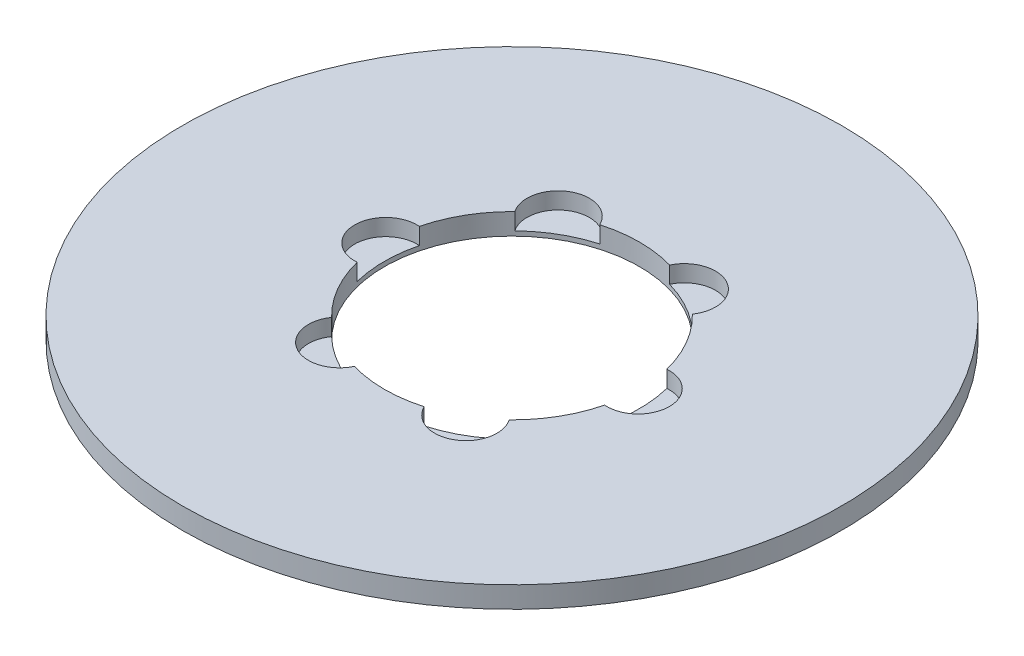
ISO-10303-21;
HEADER;
FILE_DESCRIPTION(('STEP AP214'),'2;1');
FILE_NAME('part.step','',(''),(''),'','','');
FILE_SCHEMA(('AUTOMOTIVE_DESIGN { 1 0 10303 214 1 1 1 1 }'));
ENDSEC;
DATA;
#1=APPLICATION_CONTEXT('core data for automotive mechanical design processes');
#2=APPLICATION_PROTOCOL_DEFINITION('international standard','automotive_design',2000,#1);
#3=PRODUCT_CONTEXT('',#1,'mechanical');
#4=PRODUCT('Part','Part','',(#3));
#5=PRODUCT_RELATED_PRODUCT_CATEGORY('part','',(#4));
#6=PRODUCT_DEFINITION_FORMATION('','',#4);
#7=PRODUCT_DEFINITION_CONTEXT('part definition',#1,'design');
#8=PRODUCT_DEFINITION('design','',#6,#7);
#9=PRODUCT_DEFINITION_SHAPE('','',#8);
#10=(LENGTH_UNIT() NAMED_UNIT(*) SI_UNIT(.MILLI.,.METRE.));
#11=(NAMED_UNIT(*) PLANE_ANGLE_UNIT() SI_UNIT($,.RADIAN.));
#12=(NAMED_UNIT(*) SI_UNIT($,.STERADIAN.) SOLID_ANGLE_UNIT());
#13=UNCERTAINTY_MEASURE_WITH_UNIT(LENGTH_MEASURE(1.E-05),#10,'distance_accuracy_value','');
#14=(GEOMETRIC_REPRESENTATION_CONTEXT(3) GLOBAL_UNCERTAINTY_ASSIGNED_CONTEXT((#13)) GLOBAL_UNIT_ASSIGNED_CONTEXT((#10,
#11,#12)) REPRESENTATION_CONTEXT('',''));
#15=CARTESIAN_POINT('',(0.,0.,0.));
#16=DIRECTION('',(0.,0.,1.));
#17=DIRECTION('',(1.,0.,0.));
#18=AXIS2_PLACEMENT_3D('',#15,#16,#17);
#19=CARTESIAN_POINT('',(0.,5.,0.));
#20=DIRECTION('',(0.,-1.,0.));
#21=DIRECTION('',(0.,0.,-1.));
#22=AXIS2_PLACEMENT_3D('',#19,#20,#21);
#23=CYLINDRICAL_SURFACE('',#22,77.5);
#24=CARTESIAN_POINT('',(0.,5.,0.));
#25=DIRECTION('',(0.,1.,0.));
#26=DIRECTION('',(0.,0.,1.));
#27=AXIS2_PLACEMENT_3D('',#24,#25,#26);
#28=CIRCLE('',#27,77.5);
#29=CARTESIAN_POINT('',(0.,5.,77.5));
#30=VERTEX_POINT('',#29);
#31=EDGE_CURVE('E171',#30,#30,#28,.T.);
#32=ORIENTED_EDGE('',*,*,#31,.F.);
#33=EDGE_LOOP('',(#32));
#34=FACE_BOUND('',#33,.T.);
#35=CARTESIAN_POINT('',(0.,0.,0.));
#36=DIRECTION('',(0.,1.,0.));
#37=DIRECTION('',(0.,0.,1.));
#38=AXIS2_PLACEMENT_3D('',#35,#36,#37);
#39=CIRCLE('',#38,77.5);
#40=CARTESIAN_POINT('',(0.,0.,77.5));
#41=VERTEX_POINT('',#40);
#42=EDGE_CURVE('E157',#41,#41,#39,.T.);
#43=ORIENTED_EDGE('',*,*,#42,.T.);
#44=EDGE_LOOP('',(#43));
#45=FACE_BOUND('',#44,.T.);
#46=ADVANCED_FACE('F39',(#34,#45),#23,.T.);
#47=CARTESIAN_POINT('',(0.,5.,0.));
#48=DIRECTION('',(0.,1.,0.));
#49=DIRECTION('',(0.,0.,1.));
#50=AXIS2_PLACEMENT_3D('',#47,#48,#49);
#51=PLANE('',#50);
#52=CARTESIAN_POINT('',(-14.8331722885129,5.,-25.6918080411264));
#53=DIRECTION('',(0.,1.,0.));
#54=DIRECTION('',(-0.866025403784433,0.,0.50000000000001));
#55=AXIS2_PLACEMENT_3D('',#52,#53,#54);
#56=CIRCLE('',#55,7.33525519988317);
#57=CARTESIAN_POINT('',(-8.21429246454717,5.,-28.8535162381794));
#58=VERTEX_POINT('',#57);
#59=CARTESIAN_POINT('',(-20.8807318184971,5.,-21.5405440675022));
#60=VERTEX_POINT('',#59);
#61=EDGE_CURVE('E214',#58,#60,#56,.T.);
#62=ORIENTED_EDGE('',*,*,#61,.F.);
#63=CARTESIAN_POINT('',(0.,5.,0.));
#64=DIRECTION('',(0.,1.,0.));
#65=DIRECTION('',(0.,0.,1.));
#66=AXIS2_PLACEMENT_3D('',#63,#64,#65);
#67=CIRCLE('',#66,30.);
#68=CARTESIAN_POINT('',(8.21429246454656,5.,-28.8535162381796));
#69=VERTEX_POINT('',#68);
#70=EDGE_CURVE('E272',#69,#58,#67,.T.);
#71=ORIENTED_EDGE('',*,*,#70,.F.);
#72=CARTESIAN_POINT('',(14.8331722885124,5.,-25.6918080411267));
#73=DIRECTION('',(0.,1.,0.));
#74=DIRECTION('',(-0.866025403784443,0.,-0.499999999999992));
#75=AXIS2_PLACEMENT_3D('',#72,#73,#74);
#76=CIRCLE('',#75,7.33525519988317);
#77=CARTESIAN_POINT('',(20.8807318184967,5.,-21.5405440675026));
#78=VERTEX_POINT('',#77);
#79=EDGE_CURVE('E285',#78,#69,#76,.T.);
#80=ORIENTED_EDGE('',*,*,#79,.F.);
#81=CARTESIAN_POINT('',(29.0950242830437,5.,-7.31297217067711));
#82=VERTEX_POINT('',#81);
#83=EDGE_CURVE('E165',#82,#78,#67,.T.);
#84=ORIENTED_EDGE('',*,*,#83,.F.);
#85=CARTESIAN_POINT('',(29.6663445770253,5.,0.));
#86=DIRECTION('',(0.,1.,0.));
#87=DIRECTION('',(0.,0.,-1.));
#88=AXIS2_PLACEMENT_3D('',#85,#86,#87);
#89=CIRCLE('',#88,7.33525519988317);
#90=CARTESIAN_POINT('',(29.0950242830437,5.,7.31297217067711));
#91=VERTEX_POINT('',#90);
#92=EDGE_CURVE('E281',#91,#82,#89,.T.);
#93=ORIENTED_EDGE('',*,*,#92,.F.);
#94=CARTESIAN_POINT('',(20.880731818497,5.,21.5405440675023));
#95=VERTEX_POINT('',#94);
#96=EDGE_CURVE('E160',#95,#91,#67,.T.);
#97=ORIENTED_EDGE('',*,*,#96,.F.);
#98=CARTESIAN_POINT('',(14.8331722885128,5.,25.6918080411265));
#99=DIRECTION('',(0.,1.,0.));
#100=DIRECTION('',(0.866025403784436,0.,-0.500000000000004));
#101=AXIS2_PLACEMENT_3D('',#98,#99,#100);
#102=CIRCLE('',#101,7.33525519988317);
#103=CARTESIAN_POINT('',(8.21429246454697,5.,28.8535162381795));
#104=VERTEX_POINT('',#103);
#105=EDGE_CURVE('E154',#104,#95,#102,.T.);
#106=ORIENTED_EDGE('',*,*,#105,.F.);
#107=CARTESIAN_POINT('',(-8.21429246454677,5.,28.8535162381795));
#108=VERTEX_POINT('',#107);
#109=EDGE_CURVE('E150',#108,#104,#67,.T.);
#110=ORIENTED_EDGE('',*,*,#109,.F.);
#111=CARTESIAN_POINT('',(-14.8331722885126,5.,25.6918080411266));
#112=DIRECTION('',(0.,1.,0.));
#113=DIRECTION('',(0.86602540378444,0.,0.499999999999998));
#114=AXIS2_PLACEMENT_3D('',#111,#112,#113);
#115=CIRCLE('',#114,7.33525519988317);
#116=CARTESIAN_POINT('',(-20.8807318184968,5.,21.5405440675024));
#117=VERTEX_POINT('',#116);
#118=EDGE_CURVE('E127',#117,#108,#115,.T.);
#119=ORIENTED_EDGE('',*,*,#118,.F.);
#120=CARTESIAN_POINT('',(-29.0950242830437,5.,7.31297217067711));
#121=VERTEX_POINT('',#120);
#122=EDGE_CURVE('E156',#121,#117,#67,.T.);
#123=ORIENTED_EDGE('',*,*,#122,.F.);
#124=CARTESIAN_POINT('',(-29.6663445770253,5.,0.));
#125=DIRECTION('',(0.,1.,0.));
#126=DIRECTION('',(0.,0.,1.));
#127=AXIS2_PLACEMENT_3D('',#124,#125,#126);
#128=CIRCLE('',#127,7.33525519988317);
#129=CARTESIAN_POINT('',(-29.0950242830437,5.,-7.31297217067711));
#130=VERTEX_POINT('',#129);
#131=EDGE_CURVE('E164',#130,#121,#128,.T.);
#132=ORIENTED_EDGE('',*,*,#131,.F.);
#133=EDGE_CURVE('E159',#60,#130,#67,.T.);
#134=ORIENTED_EDGE('',*,*,#133,.F.);
#135=EDGE_LOOP('',(#62,#71,#80,#84,#93,#97,#106,#110,#119,#123,#132,#134));
#136=FACE_BOUND('',#135,.T.);
#137=ORIENTED_EDGE('',*,*,#31,.T.);
#138=EDGE_LOOP('',(#137));
#139=FACE_BOUND('',#138,.T.);
#140=ADVANCED_FACE('F155',(#136,#139),#51,.T.);
#141=CARTESIAN_POINT('',(0.,0.,0.));
#142=DIRECTION('',(0.,1.,0.));
#143=DIRECTION('',(0.,0.,1.));
#144=AXIS2_PLACEMENT_3D('',#141,#142,#143);
#145=PLANE('',#144);
#146=CARTESIAN_POINT('',(0.,0.,0.));
#147=DIRECTION('',(0.,1.,0.));
#148=DIRECTION('',(0.,0.,1.));
#149=AXIS2_PLACEMENT_3D('',#146,#147,#148);
#150=CIRCLE('',#149,30.);
#151=CARTESIAN_POINT('',(0.,0.,30.));
#152=VERTEX_POINT('',#151);
#153=EDGE_CURVE('E170',#152,#152,#150,.T.);
#154=ORIENTED_EDGE('',*,*,#153,.T.);
#155=EDGE_LOOP('',(#154));
#156=FACE_BOUND('',#155,.T.);
#157=ORIENTED_EDGE('',*,*,#42,.F.);
#158=EDGE_LOOP('',(#157));
#159=FACE_BOUND('',#158,.T.);
#160=ADVANCED_FACE('F232',(#156,#159),#145,.F.);
#161=CARTESIAN_POINT('',(0.,5.,0.));
#162=DIRECTION('',(0.,-1.,0.));
#163=DIRECTION('',(0.,0.,-1.));
#164=AXIS2_PLACEMENT_3D('',#161,#162,#163);
#165=CYLINDRICAL_SURFACE('',#164,30.);
#166=DIRECTION('',(0.,1.,0.));
#167=VECTOR('',#166,1.);
#168=CARTESIAN_POINT('',(-8.21429246454717,3.04326647324655,-28.8535162381794));
#169=LINE('',#168,#167);
#170=CARTESIAN_POINT('',(-8.21429246454717,1.08653294649309,-28.8535162381794));
#171=VERTEX_POINT('',#170);
#172=EDGE_CURVE('E11',#171,#58,#169,.T.);
#173=ORIENTED_EDGE('',*,*,#172,.F.);
#174=CARTESIAN_POINT('',(0.,1.08653294649309,0.));
#175=DIRECTION('',(0.,1.,0.));
#176=DIRECTION('',(0.,0.,1.));
#177=AXIS2_PLACEMENT_3D('',#174,#175,#176);
#178=CIRCLE('',#177,30.);
#179=CARTESIAN_POINT('',(-20.8807318184971,1.08653294649309,-21.5405440675022));
#180=VERTEX_POINT('',#179);
#181=EDGE_CURVE('E209',#171,#180,#178,.T.);
#182=ORIENTED_EDGE('',*,*,#181,.T.);
#183=DIRECTION('',(0.,1.,0.));
#184=VECTOR('',#183,1.);
#185=CARTESIAN_POINT('',(-20.8807318184971,3.04326647324655,-21.5405440675022));
#186=LINE('',#185,#184);
#187=EDGE_CURVE('E46',#60,#180,#186,.F.);
#188=ORIENTED_EDGE('',*,*,#187,.F.);
#189=ORIENTED_EDGE('',*,*,#133,.T.);
#190=DIRECTION('',(0.,1.,0.));
#191=VECTOR('',#190,1.);
#192=CARTESIAN_POINT('',(-29.0950242830437,3.04326647324655,-7.31297217067711));
#193=LINE('',#192,#191);
#194=CARTESIAN_POINT('',(-29.0950242830437,1.08653294649309,-7.31297217067711));
#195=VERTEX_POINT('',#194);
#196=EDGE_CURVE('E185',#195,#130,#193,.T.);
#197=ORIENTED_EDGE('',*,*,#196,.F.);
#198=CARTESIAN_POINT('',(0.,1.08653294649309,0.));
#199=DIRECTION('',(0.,1.,0.));
#200=DIRECTION('',(0.,0.,1.));
#201=AXIS2_PLACEMENT_3D('',#198,#199,#200);
#202=CIRCLE('',#201,30.);
#203=CARTESIAN_POINT('',(-29.0950242830437,1.08653294649309,7.31297217067711));
#204=VERTEX_POINT('',#203);
#205=EDGE_CURVE('E173',#195,#204,#202,.T.);
#206=ORIENTED_EDGE('',*,*,#205,.T.);
#207=DIRECTION('',(0.,1.,0.));
#208=VECTOR('',#207,1.);
#209=CARTESIAN_POINT('',(-29.0950242830437,3.04326647324655,7.31297217067711));
#210=LINE('',#209,#208);
#211=EDGE_CURVE('E178',#121,#204,#210,.F.);
#212=ORIENTED_EDGE('',*,*,#211,.F.);
#213=ORIENTED_EDGE('',*,*,#122,.T.);
#214=DIRECTION('',(0.,1.,0.));
#215=VECTOR('',#214,1.);
#216=CARTESIAN_POINT('',(-20.8807318184968,3.04326647324655,21.5405440675025));
#217=LINE('',#216,#215);
#218=CARTESIAN_POINT('',(-20.8807318184968,1.08653294649309,21.5405440675024));
#219=VERTEX_POINT('',#218);
#220=EDGE_CURVE('E132',#219,#117,#217,.T.);
#221=ORIENTED_EDGE('',*,*,#220,.F.);
#222=CARTESIAN_POINT('',(0.,1.08653294649309,0.));
#223=DIRECTION('',(0.,1.,0.));
#224=DIRECTION('',(0.,0.,1.));
#225=AXIS2_PLACEMENT_3D('',#222,#223,#224);
#226=CIRCLE('',#225,30.);
#227=CARTESIAN_POINT('',(-8.21429246454677,1.08653294649309,28.8535162381795));
#228=VERTEX_POINT('',#227);
#229=EDGE_CURVE('E146',#219,#228,#226,.T.);
#230=ORIENTED_EDGE('',*,*,#229,.T.);
#231=DIRECTION('',(0.,1.,0.));
#232=VECTOR('',#231,1.);
#233=CARTESIAN_POINT('',(-8.21429246454677,3.04326647324655,28.8535162381795));
#234=LINE('',#233,#232);
#235=EDGE_CURVE('E128',#108,#228,#234,.F.);
#236=ORIENTED_EDGE('',*,*,#235,.F.);
#237=ORIENTED_EDGE('',*,*,#109,.T.);
#238=DIRECTION('',(0.,1.,0.));
#239=VECTOR('',#238,1.);
#240=CARTESIAN_POINT('',(8.21429246454697,3.04326647324655,28.8535162381795));
#241=LINE('',#240,#239);
#242=CARTESIAN_POINT('',(8.21429246454697,1.08653294649309,28.8535162381795));
#243=VERTEX_POINT('',#242);
#244=EDGE_CURVE('E192',#243,#104,#241,.T.);
#245=ORIENTED_EDGE('',*,*,#244,.F.);
#246=CARTESIAN_POINT('',(0.,1.08653294649309,0.));
#247=DIRECTION('',(0.,1.,0.));
#248=DIRECTION('',(0.,0.,1.));
#249=AXIS2_PLACEMENT_3D('',#246,#247,#248);
#250=CIRCLE('',#249,30.);
#251=CARTESIAN_POINT('',(20.880731818497,1.08653294649309,21.5405440675023));
#252=VERTEX_POINT('',#251);
#253=EDGE_CURVE('E190',#243,#252,#250,.T.);
#254=ORIENTED_EDGE('',*,*,#253,.T.);
#255=DIRECTION('',(0.,1.,0.));
#256=VECTOR('',#255,1.);
#257=CARTESIAN_POINT('',(20.880731818497,3.04326647324655,21.5405440675023));
#258=LINE('',#257,#256);
#259=EDGE_CURVE('E189',#95,#252,#258,.F.);
#260=ORIENTED_EDGE('',*,*,#259,.F.);
#261=ORIENTED_EDGE('',*,*,#96,.T.);
#262=DIRECTION('',(0.,1.,0.));
#263=VECTOR('',#262,1.);
#264=CARTESIAN_POINT('',(29.0950242830437,3.04326647324655,7.31297217067711));
#265=LINE('',#264,#263);
#266=CARTESIAN_POINT('',(29.0950242830437,1.08653294649309,7.31297217067711));
#267=VERTEX_POINT('',#266);
#268=EDGE_CURVE('E203',#267,#91,#265,.T.);
#269=ORIENTED_EDGE('',*,*,#268,.F.);
#270=CARTESIAN_POINT('',(0.,1.08653294649309,0.));
#271=DIRECTION('',(0.,1.,0.));
#272=DIRECTION('',(0.,0.,1.));
#273=AXIS2_PLACEMENT_3D('',#270,#271,#272);
#274=CIRCLE('',#273,30.);
#275=CARTESIAN_POINT('',(29.0950242830437,1.08653294649309,-7.31297217067711));
#276=VERTEX_POINT('',#275);
#277=EDGE_CURVE('E194',#267,#276,#274,.T.);
#278=ORIENTED_EDGE('',*,*,#277,.T.);
#279=DIRECTION('',(0.,1.,0.));
#280=VECTOR('',#279,1.);
#281=CARTESIAN_POINT('',(29.0950242830437,3.04326647324655,-7.31297217067711));
#282=LINE('',#281,#280);
#283=EDGE_CURVE('E196',#82,#276,#282,.F.);
#284=ORIENTED_EDGE('',*,*,#283,.F.);
#285=ORIENTED_EDGE('',*,*,#83,.T.);
#286=DIRECTION('',(0.,1.,0.));
#287=VECTOR('',#286,1.);
#288=CARTESIAN_POINT('',(20.8807318184967,3.04326647324655,-21.5405440675026));
#289=LINE('',#288,#287);
#290=CARTESIAN_POINT('',(20.8807318184967,1.08653294649309,-21.5405440675026));
#291=VERTEX_POINT('',#290);
#292=EDGE_CURVE('E208',#291,#78,#289,.T.);
#293=ORIENTED_EDGE('',*,*,#292,.F.);
#294=CARTESIAN_POINT('',(0.,1.08653294649309,0.));
#295=DIRECTION('',(0.,1.,0.));
#296=DIRECTION('',(0.,0.,1.));
#297=AXIS2_PLACEMENT_3D('',#294,#295,#296);
#298=CIRCLE('',#297,30.);
#299=CARTESIAN_POINT('',(8.21429246454656,1.08653294649309,-28.8535162381796));
#300=VERTEX_POINT('',#299);
#301=EDGE_CURVE('E201',#291,#300,#298,.T.);
#302=ORIENTED_EDGE('',*,*,#301,.T.);
#303=DIRECTION('',(0.,1.,0.));
#304=VECTOR('',#303,1.);
#305=CARTESIAN_POINT('',(8.21429246454657,3.04326647324655,-28.8535162381796));
#306=LINE('',#305,#304);
#307=EDGE_CURVE('E206',#69,#300,#306,.F.);
#308=ORIENTED_EDGE('',*,*,#307,.F.);
#309=ORIENTED_EDGE('',*,*,#70,.T.);
#310=EDGE_LOOP('',(#173,#182,#188,#189,#197,#206,#212,#213,#221,#230,#236,#237,#245,#254,#260,
#261,#269,#278,#284,#285,#293,#302,#308,#309));
#311=FACE_BOUND('',#310,.T.);
#312=ORIENTED_EDGE('',*,*,#153,.F.);
#313=EDGE_LOOP('',(#312));
#314=FACE_BOUND('',#313,.T.);
#315=ADVANCED_FACE('F145',(#311,#314),#165,.F.);
#316=CARTESIAN_POINT('',(-29.6663445770253,1.08653294649309,0.));
#317=DIRECTION('',(0.,1.,0.));
#318=DIRECTION('',(0.,0.,1.));
#319=AXIS2_PLACEMENT_3D('',#316,#317,#318);
#320=CYLINDRICAL_SURFACE('',#319,7.33525519988317);
#321=ORIENTED_EDGE('',*,*,#196,.T.);
#322=ORIENTED_EDGE('',*,*,#131,.T.);
#323=ORIENTED_EDGE('',*,*,#211,.T.);
#324=CARTESIAN_POINT('',(-29.6663445770253,1.08653294649309,0.));
#325=DIRECTION('',(0.,1.,0.));
#326=DIRECTION('',(0.,0.,1.));
#327=AXIS2_PLACEMENT_3D('',#324,#325,#326);
#328=CIRCLE('',#327,7.33525519988317);
#329=EDGE_CURVE('E168',#195,#204,#328,.T.);
#330=ORIENTED_EDGE('',*,*,#329,.F.);
#331=EDGE_LOOP('',(#321,#322,#323,#330));
#332=FACE_BOUND('',#331,.T.);
#333=ADVANCED_FACE('F243',(#332),#320,.F.);
#334=CARTESIAN_POINT('',(-29.6663445770253,1.08653294649309,0.));
#335=DIRECTION('',(0.,1.,0.));
#336=DIRECTION('',(0.,0.,1.));
#337=AXIS2_PLACEMENT_3D('',#334,#335,#336);
#338=PLANE('',#337);
#339=ORIENTED_EDGE('',*,*,#329,.T.);
#340=ORIENTED_EDGE('',*,*,#205,.F.);
#341=EDGE_LOOP('',(#339,#340));
#342=FACE_BOUND('',#341,.T.);
#343=ADVANCED_FACE('F247',(#342),#338,.T.);
#344=CARTESIAN_POINT('',(-14.8331722885126,1.08653294649309,25.6918080411266));
#345=DIRECTION('',(0.,1.,0.));
#346=DIRECTION('',(0.,0.,1.));
#347=AXIS2_PLACEMENT_3D('',#344,#345,#346);
#348=CYLINDRICAL_SURFACE('',#347,7.33525519988317);
#349=ORIENTED_EDGE('',*,*,#220,.T.);
#350=ORIENTED_EDGE('',*,*,#118,.T.);
#351=ORIENTED_EDGE('',*,*,#235,.T.);
#352=CARTESIAN_POINT('',(-14.8331722885126,1.08653294649309,25.6918080411266));
#353=DIRECTION('',(0.,1.,0.));
#354=DIRECTION('',(0.86602540378444,0.,0.499999999999998));
#355=AXIS2_PLACEMENT_3D('',#352,#353,#354);
#356=CIRCLE('',#355,7.33525519988317);
#357=EDGE_CURVE('E137',#219,#228,#356,.T.);
#358=ORIENTED_EDGE('',*,*,#357,.F.);
#359=EDGE_LOOP('',(#349,#350,#351,#358));
#360=FACE_BOUND('',#359,.T.);
#361=ADVANCED_FACE('F126',(#360),#348,.F.);
#362=CARTESIAN_POINT('',(-14.8331722885126,1.08653294649309,25.6918080411266));
#363=DIRECTION('',(0.,1.,0.));
#364=DIRECTION('',(0.86602540378444,0.,0.499999999999998));
#365=AXIS2_PLACEMENT_3D('',#362,#363,#364);
#366=PLANE('',#365);
#367=ORIENTED_EDGE('',*,*,#357,.T.);
#368=ORIENTED_EDGE('',*,*,#229,.F.);
#369=EDGE_LOOP('',(#367,#368));
#370=FACE_BOUND('',#369,.T.);
#371=ADVANCED_FACE('F254',(#370),#366,.T.);
#372=CARTESIAN_POINT('',(14.8331722885128,1.08653294649309,25.6918080411265));
#373=DIRECTION('',(0.,1.,0.));
#374=DIRECTION('',(0.,0.,1.));
#375=AXIS2_PLACEMENT_3D('',#372,#373,#374);
#376=CYLINDRICAL_SURFACE('',#375,7.33525519988317);
#377=ORIENTED_EDGE('',*,*,#244,.T.);
#378=ORIENTED_EDGE('',*,*,#105,.T.);
#379=ORIENTED_EDGE('',*,*,#259,.T.);
#380=CARTESIAN_POINT('',(14.8331722885128,1.08653294649309,25.6918080411265));
#381=DIRECTION('',(0.,1.,0.));
#382=DIRECTION('',(0.866025403784436,0.,-0.500000000000004));
#383=AXIS2_PLACEMENT_3D('',#380,#381,#382);
#384=CIRCLE('',#383,7.33525519988317);
#385=EDGE_CURVE('E138',#243,#252,#384,.T.);
#386=ORIENTED_EDGE('',*,*,#385,.F.);
#387=EDGE_LOOP('',(#377,#378,#379,#386));
#388=FACE_BOUND('',#387,.T.);
#389=ADVANCED_FACE('F260',(#388),#376,.F.);
#390=CARTESIAN_POINT('',(14.8331722885128,1.08653294649309,25.6918080411265));
#391=DIRECTION('',(0.,1.,0.));
#392=DIRECTION('',(0.866025403784436,0.,-0.500000000000004));
#393=AXIS2_PLACEMENT_3D('',#390,#391,#392);
#394=PLANE('',#393);
#395=ORIENTED_EDGE('',*,*,#385,.T.);
#396=ORIENTED_EDGE('',*,*,#253,.F.);
#397=EDGE_LOOP('',(#395,#396));
#398=FACE_BOUND('',#397,.T.);
#399=ADVANCED_FACE('F265',(#398),#394,.T.);
#400=CARTESIAN_POINT('',(29.6663445770253,1.08653294649309,0.));
#401=DIRECTION('',(0.,1.,0.));
#402=DIRECTION('',(0.,0.,1.));
#403=AXIS2_PLACEMENT_3D('',#400,#401,#402);
#404=CYLINDRICAL_SURFACE('',#403,7.33525519988317);
#405=ORIENTED_EDGE('',*,*,#268,.T.);
#406=ORIENTED_EDGE('',*,*,#92,.T.);
#407=ORIENTED_EDGE('',*,*,#283,.T.);
#408=CARTESIAN_POINT('',(29.6663445770253,1.08653294649309,0.));
#409=DIRECTION('',(0.,1.,0.));
#410=DIRECTION('',(0.,0.,-1.));
#411=AXIS2_PLACEMENT_3D('',#408,#409,#410);
#412=CIRCLE('',#411,7.33525519988317);
#413=EDGE_CURVE('E287',#267,#276,#412,.T.);
#414=ORIENTED_EDGE('',*,*,#413,.F.);
#415=EDGE_LOOP('',(#405,#406,#407,#414));
#416=FACE_BOUND('',#415,.T.);
#417=ADVANCED_FACE('F300',(#416),#404,.F.);
#418=CARTESIAN_POINT('',(29.6663445770253,1.08653294649309,0.));
#419=DIRECTION('',(0.,1.,0.));
#420=DIRECTION('',(0.,0.,-1.));
#421=AXIS2_PLACEMENT_3D('',#418,#419,#420);
#422=PLANE('',#421);
#423=ORIENTED_EDGE('',*,*,#413,.T.);
#424=ORIENTED_EDGE('',*,*,#277,.F.);
#425=EDGE_LOOP('',(#423,#424));
#426=FACE_BOUND('',#425,.T.);
#427=ADVANCED_FACE('F298',(#426),#422,.T.);
#428=CARTESIAN_POINT('',(14.8331722885124,1.08653294649309,-25.6918080411267));
#429=DIRECTION('',(0.,1.,0.));
#430=DIRECTION('',(0.,0.,1.));
#431=AXIS2_PLACEMENT_3D('',#428,#429,#430);
#432=CYLINDRICAL_SURFACE('',#431,7.33525519988317);
#433=ORIENTED_EDGE('',*,*,#292,.T.);
#434=ORIENTED_EDGE('',*,*,#79,.T.);
#435=ORIENTED_EDGE('',*,*,#307,.T.);
#436=CARTESIAN_POINT('',(14.8331722885124,1.08653294649309,-25.6918080411267));
#437=DIRECTION('',(0.,1.,0.));
#438=DIRECTION('',(-0.866025403784443,0.,-0.499999999999992));
#439=AXIS2_PLACEMENT_3D('',#436,#437,#438);
#440=CIRCLE('',#439,7.33525519988317);
#441=EDGE_CURVE('E56',#291,#300,#440,.T.);
#442=ORIENTED_EDGE('',*,*,#441,.F.);
#443=EDGE_LOOP('',(#433,#434,#435,#442));
#444=FACE_BOUND('',#443,.T.);
#445=ADVANCED_FACE('F301',(#444),#432,.F.);
#446=CARTESIAN_POINT('',(14.8331722885124,1.08653294649309,-25.6918080411267));
#447=DIRECTION('',(0.,1.,0.));
#448=DIRECTION('',(-0.866025403784443,0.,-0.499999999999992));
#449=AXIS2_PLACEMENT_3D('',#446,#447,#448);
#450=PLANE('',#449);
#451=ORIENTED_EDGE('',*,*,#441,.T.);
#452=ORIENTED_EDGE('',*,*,#301,.F.);
#453=EDGE_LOOP('',(#451,#452));
#454=FACE_BOUND('',#453,.T.);
#455=ADVANCED_FACE('F221',(#454),#450,.T.);
#456=CARTESIAN_POINT('',(-14.8331722885129,1.08653294649309,-25.6918080411264));
#457=DIRECTION('',(0.,1.,0.));
#458=DIRECTION('',(0.,0.,1.));
#459=AXIS2_PLACEMENT_3D('',#456,#457,#458);
#460=CYLINDRICAL_SURFACE('',#459,7.33525519988317);
#461=ORIENTED_EDGE('',*,*,#172,.T.);
#462=ORIENTED_EDGE('',*,*,#61,.T.);
#463=ORIENTED_EDGE('',*,*,#187,.T.);
#464=CARTESIAN_POINT('',(-14.8331722885129,1.08653294649309,-25.6918080411264));
#465=DIRECTION('',(0.,1.,0.));
#466=DIRECTION('',(-0.866025403784433,0.,0.50000000000001));
#467=AXIS2_PLACEMENT_3D('',#464,#465,#466);
#468=CIRCLE('',#467,7.33525519988317);
#469=EDGE_CURVE('E55',#171,#180,#468,.T.);
#470=ORIENTED_EDGE('',*,*,#469,.F.);
#471=EDGE_LOOP('',(#461,#462,#463,#470));
#472=FACE_BOUND('',#471,.T.);
#473=ADVANCED_FACE('F212',(#472),#460,.F.);
#474=CARTESIAN_POINT('',(-14.8331722885129,1.08653294649309,-25.6918080411264));
#475=DIRECTION('',(0.,1.,0.));
#476=DIRECTION('',(-0.866025403784433,0.,0.50000000000001));
#477=AXIS2_PLACEMENT_3D('',#474,#475,#476);
#478=PLANE('',#477);
#479=ORIENTED_EDGE('',*,*,#469,.T.);
#480=ORIENTED_EDGE('',*,*,#181,.F.);
#481=EDGE_LOOP('',(#479,#480));
#482=FACE_BOUND('',#481,.T.);
#483=ADVANCED_FACE('F217',(#482),#478,.T.);
#484=CLOSED_SHELL('',(#46,#140,#160,#315,#333,#343,#361,#371,#389,#399,#417,#427,#445,#455,#473,#483));
#485=MANIFOLD_SOLID_BREP('B2',#484);
#486=ADVANCED_BREP_SHAPE_REPRESENTATION('',(#18,#485),#14);
#487=SHAPE_DEFINITION_REPRESENTATION(#9,#486);
ENDSEC;
END-ISO-10303-21;
